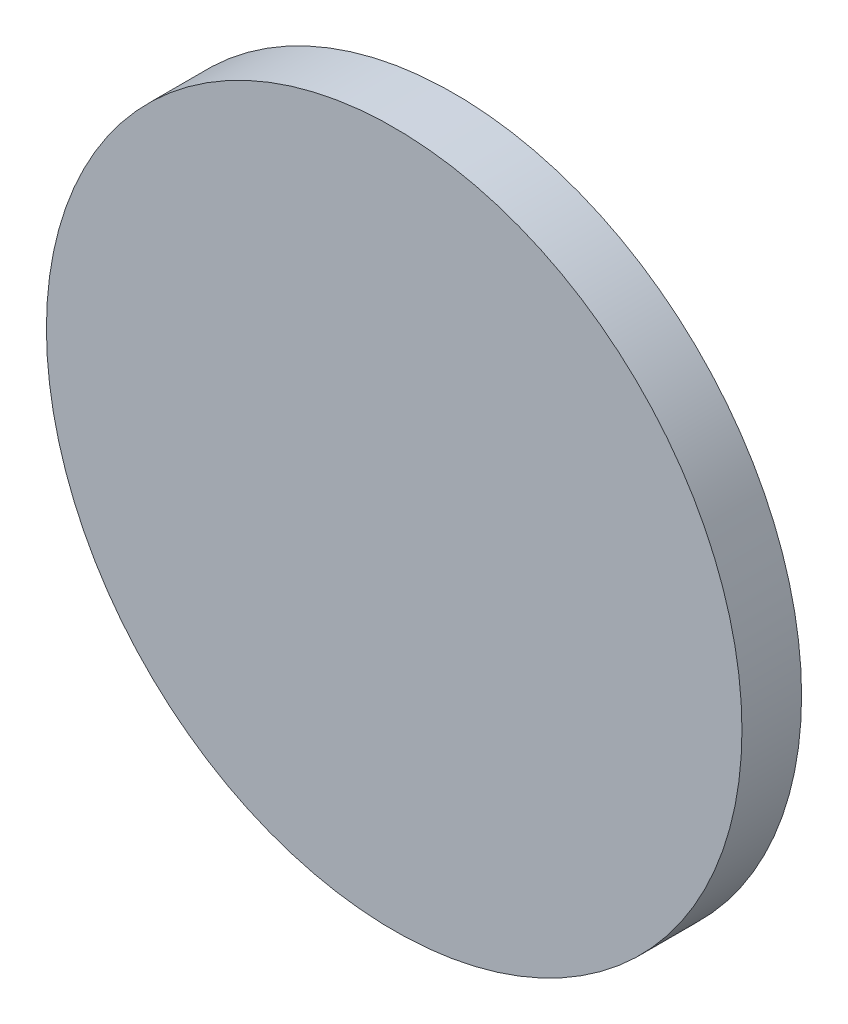
ISO-10303-21;
HEADER;
FILE_DESCRIPTION(('STEP AP214'),'2;1');
FILE_NAME('part.step','',(''),(''),'','','');
FILE_SCHEMA(('AUTOMOTIVE_DESIGN { 1 0 10303 214 1 1 1 1 }'));
ENDSEC;
DATA;
#1=APPLICATION_CONTEXT('core data for automotive mechanical design processes');
#2=APPLICATION_PROTOCOL_DEFINITION('international standard','automotive_design',2000,#1);
#3=PRODUCT_CONTEXT('',#1,'mechanical');
#4=PRODUCT('Part','Part','',(#3));
#5=PRODUCT_RELATED_PRODUCT_CATEGORY('part','',(#4));
#6=PRODUCT_DEFINITION_FORMATION('','',#4);
#7=PRODUCT_DEFINITION_CONTEXT('part definition',#1,'design');
#8=PRODUCT_DEFINITION('design','',#6,#7);
#9=PRODUCT_DEFINITION_SHAPE('','',#8);
#10=(LENGTH_UNIT() NAMED_UNIT(*) SI_UNIT(.MILLI.,.METRE.));
#11=(NAMED_UNIT(*) PLANE_ANGLE_UNIT() SI_UNIT($,.RADIAN.));
#12=(NAMED_UNIT(*) SI_UNIT($,.STERADIAN.) SOLID_ANGLE_UNIT());
#13=UNCERTAINTY_MEASURE_WITH_UNIT(LENGTH_MEASURE(1.E-05),#10,'distance_accuracy_value','');
#14=(GEOMETRIC_REPRESENTATION_CONTEXT(3) GLOBAL_UNCERTAINTY_ASSIGNED_CONTEXT((#13)) GLOBAL_UNIT_ASSIGNED_CONTEXT((#10,
#11,#12)) REPRESENTATION_CONTEXT('',''));
#15=CARTESIAN_POINT('',(0.,0.,0.));
#16=DIRECTION('',(0.,0.,1.));
#17=DIRECTION('',(1.,0.,0.));
#18=AXIS2_PLACEMENT_3D('',#15,#16,#17);
#19=CARTESIAN_POINT('',(1.30008,10.400000006176,0.03429));
#20=DIRECTION('',(0.,0.,1.));
#21=DIRECTION('',(1.,0.,0.));
#22=AXIS2_PLACEMENT_3D('',#19,#20,#21);
#23=PLANE('',#22);
#24=CARTESIAN_POINT('',(1.30008,10.400000006176,0.03429));
#25=DIRECTION('',(0.,0.,1.));
#26=DIRECTION('',(1.,0.,0.));
#27=AXIS2_PLACEMENT_3D('',#24,#25,#26);
#28=CIRCLE('',#27,0.200024667);
#29=CARTESIAN_POINT('',(1.500104667,10.400000006176,0.03429));
#30=VERTEX_POINT('',#29);
#31=EDGE_CURVE('E18',#30,#30,#28,.F.);
#32=ORIENTED_EDGE('',*,*,#31,.F.);
#33=EDGE_LOOP('',(#32));
#34=FACE_BOUND('',#33,.T.);
#35=ADVANCED_FACE('F15',(#34),#23,.T.);
#36=CARTESIAN_POINT('',(1.30008,10.400000006176,0.));
#37=DIRECTION('',(0.,0.,1.));
#38=DIRECTION('',(1.,0.,0.));
#39=AXIS2_PLACEMENT_3D('',#36,#37,#38);
#40=CYLINDRICAL_SURFACE('',#39,0.200024667);
#41=ORIENTED_EDGE('',*,*,#31,.T.);
#42=EDGE_LOOP('',(#41));
#43=FACE_BOUND('',#42,.T.);
#44=CARTESIAN_POINT('',(1.30008,10.400000006176,0.));
#45=DIRECTION('',(0.,0.,1.));
#46=DIRECTION('',(1.,0.,0.));
#47=AXIS2_PLACEMENT_3D('',#44,#45,#46);
#48=CIRCLE('',#47,0.200024667);
#49=CARTESIAN_POINT('',(1.500104667,10.400000006176,0.));
#50=VERTEX_POINT('',#49);
#51=EDGE_CURVE('E10',#50,#50,#48,.F.);
#52=ORIENTED_EDGE('',*,*,#51,.F.);
#53=EDGE_LOOP('',(#52));
#54=FACE_BOUND('',#53,.T.);
#55=ADVANCED_FACE('F27',(#43,#54),#40,.T.);
#56=CARTESIAN_POINT('',(1.30008,10.400000006176,0.));
#57=DIRECTION('',(0.,0.,-1.));
#58=DIRECTION('',(-1.,0.,0.));
#59=AXIS2_PLACEMENT_3D('',#56,#57,#58);
#60=PLANE('',#59);
#61=ORIENTED_EDGE('',*,*,#51,.T.);
#62=EDGE_LOOP('',(#61));
#63=FACE_BOUND('',#62,.T.);
#64=ADVANCED_FACE('F35',(#63),#60,.T.);
#65=CLOSED_SHELL('',(#35,#55,#64));
#66=MANIFOLD_SOLID_BREP('B1',#65);
#67=ADVANCED_BREP_SHAPE_REPRESENTATION('',(#18,#66),#14);
#68=SHAPE_DEFINITION_REPRESENTATION(#9,#67);
ENDSEC;
END-ISO-10303-21;
